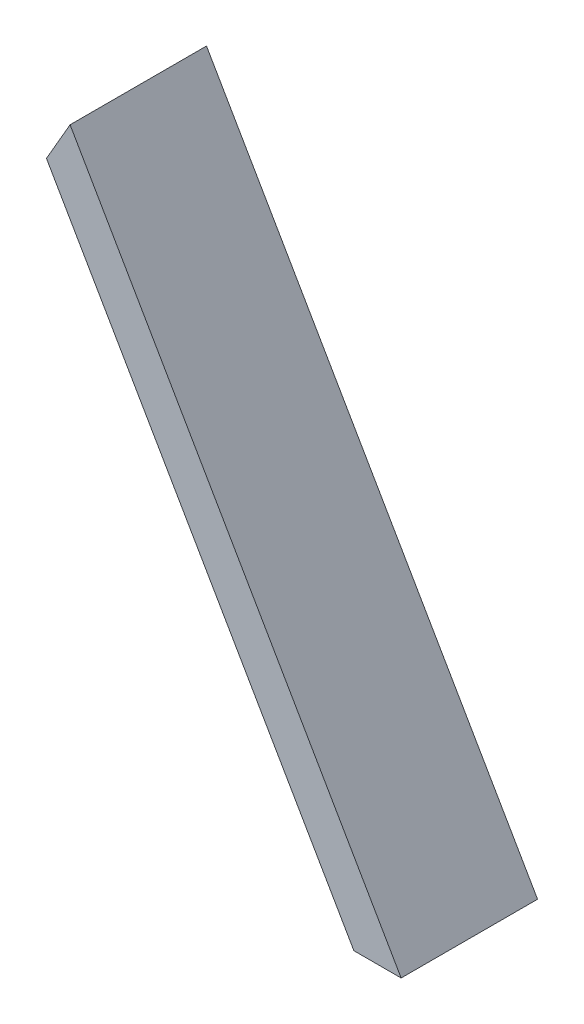
ISO-10303-21;
HEADER;
FILE_DESCRIPTION(('STEP AP214'),'2;1');
FILE_NAME('part.step','',(''),(''),'','','');
FILE_SCHEMA(('AUTOMOTIVE_DESIGN { 1 0 10303 214 1 1 1 1 }'));
ENDSEC;
DATA;
#1=APPLICATION_CONTEXT('core data for automotive mechanical design processes');
#2=APPLICATION_PROTOCOL_DEFINITION('international standard','automotive_design',2000,#1);
#3=PRODUCT_CONTEXT('',#1,'mechanical');
#4=PRODUCT('Part','Part','',(#3));
#5=PRODUCT_RELATED_PRODUCT_CATEGORY('part','',(#4));
#6=PRODUCT_DEFINITION_FORMATION('','',#4);
#7=PRODUCT_DEFINITION_CONTEXT('part definition',#1,'design');
#8=PRODUCT_DEFINITION('design','',#6,#7);
#9=PRODUCT_DEFINITION_SHAPE('','',#8);
#10=(LENGTH_UNIT() NAMED_UNIT(*) SI_UNIT(.MILLI.,.METRE.));
#11=(NAMED_UNIT(*) PLANE_ANGLE_UNIT() SI_UNIT($,.RADIAN.));
#12=(NAMED_UNIT(*) SI_UNIT($,.STERADIAN.) SOLID_ANGLE_UNIT());
#13=UNCERTAINTY_MEASURE_WITH_UNIT(LENGTH_MEASURE(1.E-05),#10,'distance_accuracy_value','');
#14=(GEOMETRIC_REPRESENTATION_CONTEXT(3) GLOBAL_UNCERTAINTY_ASSIGNED_CONTEXT((#13)) GLOBAL_UNIT_ASSIGNED_CONTEXT((#10,
#11,#12)) REPRESENTATION_CONTEXT('',''));
#15=CARTESIAN_POINT('',(0.,0.,0.));
#16=DIRECTION('',(0.,0.,1.));
#17=DIRECTION('',(1.,0.,0.));
#18=AXIS2_PLACEMENT_3D('',#15,#16,#17);
#19=CARTESIAN_POINT('',(82.5500000010972,-133.455794164517,63.5));
#20=DIRECTION('',(-2.88141574173645E-11,1.,0.));
#21=DIRECTION('',(-1.,-2.88141574173645E-11,0.));
#22=AXIS2_PLACEMENT_3D('',#19,#20,#21);
#23=PLANE('',#22);
#24=DIRECTION('',(1.,2.88141574173645E-11,0.));
#25=VECTOR('',#24,1.);
#26=CARTESIAN_POINT('',(82.5500000010972,-133.455794164517,0.));
#27=LINE('',#26,#25);
#28=CARTESIAN_POINT('',(60.5529547438747,-133.455794165151,0.));
#29=VERTEX_POINT('',#28);
#30=CARTESIAN_POINT('',(82.5500000010972,-133.455794164517,0.));
#31=VERTEX_POINT('',#30);
#32=EDGE_CURVE('E96',#29,#31,#27,.T.);
#33=ORIENTED_EDGE('',*,*,#32,.T.);
#34=DIRECTION('',(0.,0.,-1.));
#35=VECTOR('',#34,1.);
#36=CARTESIAN_POINT('',(82.5500000010972,-133.455794164517,63.5));
#37=LINE('',#36,#35);
#38=CARTESIAN_POINT('',(82.5500000010972,-133.455794164517,63.5));
#39=VERTEX_POINT('',#38);
#40=EDGE_CURVE('E11',#39,#31,#37,.T.);
#41=ORIENTED_EDGE('',*,*,#40,.F.);
#42=DIRECTION('',(1.,2.88141574173645E-11,0.));
#43=VECTOR('',#42,1.);
#44=CARTESIAN_POINT('',(82.5500000010972,-133.455794164517,63.5));
#45=LINE('',#44,#43);
#46=CARTESIAN_POINT('',(60.5529547438747,-133.455794165151,63.5));
#47=VERTEX_POINT('',#46);
#48=EDGE_CURVE('E84',#47,#39,#45,.T.);
#49=ORIENTED_EDGE('',*,*,#48,.F.);
#50=DIRECTION('',(0.,0.,-1.));
#51=VECTOR('',#50,1.);
#52=CARTESIAN_POINT('',(60.5529547438747,-133.455794165151,63.5));
#53=LINE('',#52,#51);
#54=EDGE_CURVE('E92',#47,#29,#53,.T.);
#55=ORIENTED_EDGE('',*,*,#54,.T.);
#56=EDGE_LOOP('',(#33,#41,#49,#55));
#57=FACE_BOUND('',#56,.T.);
#58=ADVANCED_FACE('F33',(#57),#23,.F.);
#59=CARTESIAN_POINT('',(82.5500000010972,-133.455794164517,63.5));
#60=DIRECTION('',(-0.866025403784439,-0.5,0.));
#61=DIRECTION('',(0.5,-0.866025403784439,0.));
#62=AXIS2_PLACEMENT_3D('',#59,#60,#61);
#63=PLANE('',#62);
#64=DIRECTION('',(-0.5,0.866025403784438,0.));
#65=VECTOR('',#64,1.);
#66=CARTESIAN_POINT('',(82.5500000010972,-133.455794164517,0.));
#67=LINE('',#66,#65);
#68=CARTESIAN_POINT('',(-71.5514773712065,133.455794165739,0.));
#69=VERTEX_POINT('',#68);
#70=EDGE_CURVE('E88',#31,#69,#67,.T.);
#71=ORIENTED_EDGE('',*,*,#70,.T.);
#72=DIRECTION('',(0.,0.,-1.));
#73=VECTOR('',#72,1.);
#74=CARTESIAN_POINT('',(-71.5514773712065,133.455794165739,63.5));
#75=LINE('',#74,#73);
#76=CARTESIAN_POINT('',(-71.5514773712065,133.455794165739,63.5));
#77=VERTEX_POINT('',#76);
#78=EDGE_CURVE('E41',#77,#69,#75,.T.);
#79=ORIENTED_EDGE('',*,*,#78,.F.);
#80=DIRECTION('',(-0.5,0.866025403784438,0.));
#81=VECTOR('',#80,1.);
#82=CARTESIAN_POINT('',(82.5500000010972,-133.455794164517,63.5));
#83=LINE('',#82,#81);
#84=EDGE_CURVE('E79',#39,#77,#83,.T.);
#85=ORIENTED_EDGE('',*,*,#84,.F.);
#86=ORIENTED_EDGE('',*,*,#40,.T.);
#87=EDGE_LOOP('',(#71,#79,#85,#86));
#88=FACE_BOUND('',#87,.T.);
#89=ADVANCED_FACE('F87',(#88),#63,.F.);
#90=CARTESIAN_POINT('',(-71.5514773712065,133.455794165739,63.5));
#91=DIRECTION('',(0.86602540378444,-0.499999999999998,0.));
#92=DIRECTION('',(0.499999999999998,0.86602540378444,0.));
#93=AXIS2_PLACEMENT_3D('',#90,#91,#92);
#94=PLANE('',#93);
#95=DIRECTION('',(-0.499999999999998,-0.86602540378444,0.));
#96=VECTOR('',#95,1.);
#97=CARTESIAN_POINT('',(-71.5514773712065,133.455794165739,0.));
#98=LINE('',#97,#96);
#99=CARTESIAN_POINT('',(-82.5500000000007,114.405794164471,0.));
#100=VERTEX_POINT('',#99);
#101=EDGE_CURVE('E66',#69,#100,#98,.T.);
#102=ORIENTED_EDGE('',*,*,#101,.T.);
#103=DIRECTION('',(0.,0.,-1.));
#104=VECTOR('',#103,1.);
#105=CARTESIAN_POINT('',(-82.5500000000007,114.405794164471,63.5));
#106=LINE('',#105,#104);
#107=CARTESIAN_POINT('',(-82.5500000000007,114.405794164471,63.5));
#108=VERTEX_POINT('',#107);
#109=EDGE_CURVE('E89',#108,#100,#106,.T.);
#110=ORIENTED_EDGE('',*,*,#109,.F.);
#111=DIRECTION('',(-0.499999999999998,-0.86602540378444,0.));
#112=VECTOR('',#111,1.);
#113=CARTESIAN_POINT('',(-71.5514773712065,133.455794165739,63.5));
#114=LINE('',#113,#112);
#115=EDGE_CURVE('E82',#77,#108,#114,.T.);
#116=ORIENTED_EDGE('',*,*,#115,.F.);
#117=ORIENTED_EDGE('',*,*,#78,.T.);
#118=EDGE_LOOP('',(#102,#110,#116,#117));
#119=FACE_BOUND('',#118,.T.);
#120=ADVANCED_FACE('F90',(#119),#94,.F.);
#121=CARTESIAN_POINT('',(60.5529547438747,-133.455794165151,63.5));
#122=DIRECTION('',(0.866025403784439,0.5,0.));
#123=DIRECTION('',(-0.5,0.866025403784439,0.));
#124=AXIS2_PLACEMENT_3D('',#121,#122,#123);
#125=PLANE('',#124);
#126=DIRECTION('',(0.5,-0.866025403784439,0.));
#127=VECTOR('',#126,1.);
#128=CARTESIAN_POINT('',(60.5529547438747,-133.455794165151,0.));
#129=LINE('',#128,#127);
#130=EDGE_CURVE('E72',#100,#29,#129,.T.);
#131=ORIENTED_EDGE('',*,*,#130,.T.);
#132=ORIENTED_EDGE('',*,*,#54,.F.);
#133=DIRECTION('',(0.5,-0.866025403784439,0.));
#134=VECTOR('',#133,1.);
#135=CARTESIAN_POINT('',(60.5529547438747,-133.455794165151,63.5));
#136=LINE('',#135,#134);
#137=EDGE_CURVE('E49',#108,#47,#136,.T.);
#138=ORIENTED_EDGE('',*,*,#137,.F.);
#139=ORIENTED_EDGE('',*,*,#109,.T.);
#140=EDGE_LOOP('',(#131,#132,#138,#139));
#141=FACE_BOUND('',#140,.T.);
#142=ADVANCED_FACE('F103',(#141),#125,.F.);
#143=CARTESIAN_POINT('',(0.,0.,63.5));
#144=DIRECTION('',(0.,0.,-1.));
#145=DIRECTION('',(-1.,0.,0.));
#146=AXIS2_PLACEMENT_3D('',#143,#144,#145);
#147=PLANE('',#146);
#148=ORIENTED_EDGE('',*,*,#48,.T.);
#149=ORIENTED_EDGE('',*,*,#84,.T.);
#150=ORIENTED_EDGE('',*,*,#115,.T.);
#151=ORIENTED_EDGE('',*,*,#137,.T.);
#152=EDGE_LOOP('',(#148,#149,#150,#151));
#153=FACE_BOUND('',#152,.T.);
#154=ADVANCED_FACE('F80',(#153),#147,.F.);
#155=CARTESIAN_POINT('',(0.,0.,0.));
#156=DIRECTION('',(0.,0.,-1.));
#157=DIRECTION('',(-1.,0.,0.));
#158=AXIS2_PLACEMENT_3D('',#155,#156,#157);
#159=PLANE('',#158);
#160=ORIENTED_EDGE('',*,*,#32,.F.);
#161=ORIENTED_EDGE('',*,*,#130,.F.);
#162=ORIENTED_EDGE('',*,*,#101,.F.);
#163=ORIENTED_EDGE('',*,*,#70,.F.);
#164=EDGE_LOOP('',(#160,#161,#162,#163));
#165=FACE_BOUND('',#164,.T.);
#166=ADVANCED_FACE('F106',(#165),#159,.T.);
#167=CLOSED_SHELL('',(#58,#89,#120,#142,#154,#166));
#168=MANIFOLD_SOLID_BREP('B2',#167);
#169=ADVANCED_BREP_SHAPE_REPRESENTATION('',(#18,#168),#14);
#170=SHAPE_DEFINITION_REPRESENTATION(#9,#169);
ENDSEC;
END-ISO-10303-21;
